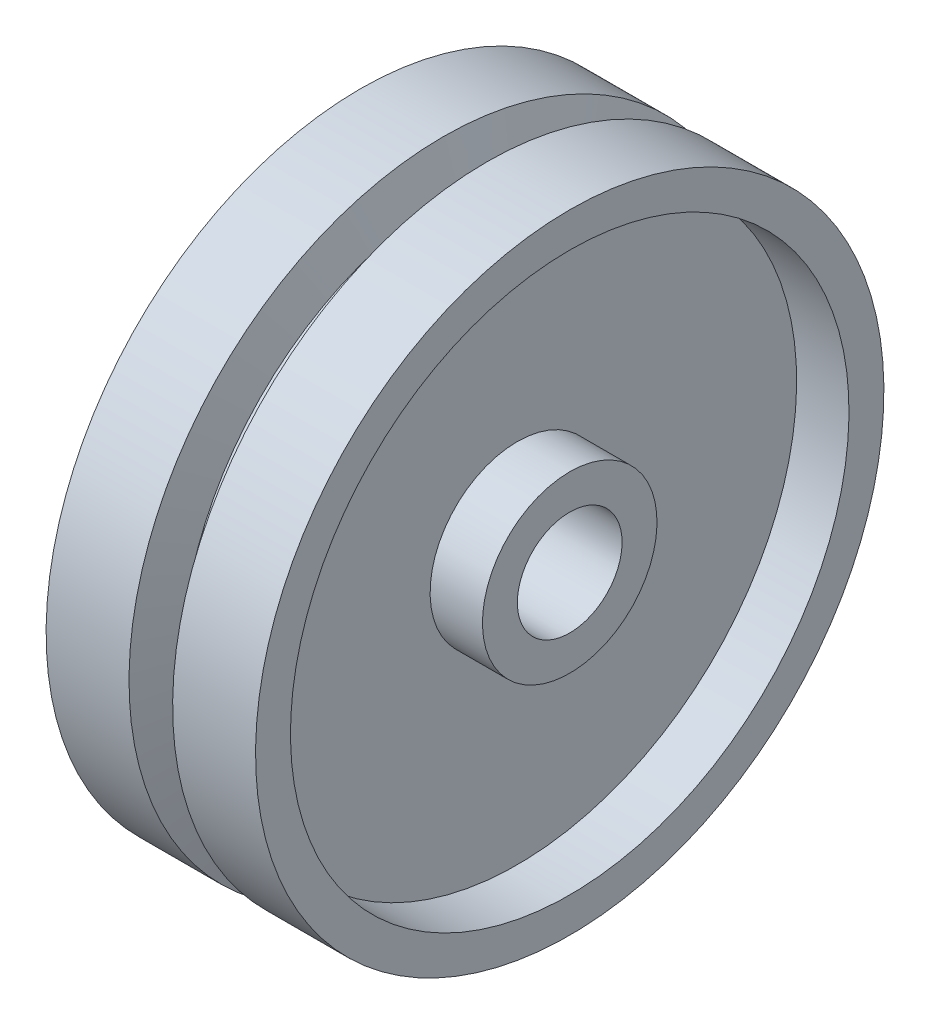
ISO-10303-21;
HEADER;
FILE_DESCRIPTION(('STEP AP214'),'2;1');
FILE_NAME('part.step','',(''),(''),'','','');
FILE_SCHEMA(('AUTOMOTIVE_DESIGN { 1 0 10303 214 1 1 1 1 }'));
ENDSEC;
DATA;
#1=APPLICATION_CONTEXT('core data for automotive mechanical design processes');
#2=APPLICATION_PROTOCOL_DEFINITION('international standard','automotive_design',2000,#1);
#3=PRODUCT_CONTEXT('',#1,'mechanical');
#4=PRODUCT('Part','Part','',(#3));
#5=PRODUCT_RELATED_PRODUCT_CATEGORY('part','',(#4));
#6=PRODUCT_DEFINITION_FORMATION('','',#4);
#7=PRODUCT_DEFINITION_CONTEXT('part definition',#1,'design');
#8=PRODUCT_DEFINITION('design','',#6,#7);
#9=PRODUCT_DEFINITION_SHAPE('','',#8);
#10=(LENGTH_UNIT() NAMED_UNIT(*) SI_UNIT(.MILLI.,.METRE.));
#11=(NAMED_UNIT(*) PLANE_ANGLE_UNIT() SI_UNIT($,.RADIAN.));
#12=(NAMED_UNIT(*) SI_UNIT($,.STERADIAN.) SOLID_ANGLE_UNIT());
#13=UNCERTAINTY_MEASURE_WITH_UNIT(LENGTH_MEASURE(1.E-05),#10,'distance_accuracy_value','');
#14=(GEOMETRIC_REPRESENTATION_CONTEXT(3) GLOBAL_UNCERTAINTY_ASSIGNED_CONTEXT((#13)) GLOBAL_UNIT_ASSIGNED_CONTEXT((#10,
#11,#12)) REPRESENTATION_CONTEXT('',''));
#15=CARTESIAN_POINT('',(0.,0.,0.));
#16=DIRECTION('',(0.,0.,1.));
#17=DIRECTION('',(1.,0.,0.));
#18=AXIS2_PLACEMENT_3D('',#15,#16,#17);
#19=CARTESIAN_POINT('',(0.,5.,0.));
#20=DIRECTION('',(1.,0.,0.));
#21=DIRECTION('',(0.,1.,0.));
#22=AXIS2_PLACEMENT_3D('',#19,#20,#21);
#23=PLANE('',#22);
#24=CARTESIAN_POINT('',(0.,0.,0.));
#25=DIRECTION('',(1.,0.,0.));
#26=DIRECTION('',(0.,1.,0.));
#27=AXIS2_PLACEMENT_3D('',#24,#25,#26);
#28=CIRCLE('',#27,5.);
#29=CARTESIAN_POINT('',(0.,5.,0.));
#30=VERTEX_POINT('',#29);
#31=EDGE_CURVE('E126',#30,#30,#28,.T.);
#32=ORIENTED_EDGE('',*,*,#31,.T.);
#33=EDGE_LOOP('',(#32));
#34=FACE_BOUND('',#33,.T.);
#35=CARTESIAN_POINT('',(0.,0.,0.));
#36=DIRECTION('',(1.,0.,0.));
#37=DIRECTION('',(0.,1.,0.));
#38=AXIS2_PLACEMENT_3D('',#35,#36,#37);
#39=CIRCLE('',#38,3.);
#40=CARTESIAN_POINT('',(0.,3.,0.));
#41=VERTEX_POINT('',#40);
#42=EDGE_CURVE('E10',#41,#41,#39,.T.);
#43=ORIENTED_EDGE('',*,*,#42,.F.);
#44=EDGE_LOOP('',(#43));
#45=FACE_BOUND('',#44,.T.);
#46=ADVANCED_FACE('F43',(#34,#45),#23,.T.);
#47=CARTESIAN_POINT('',(0.,0.,0.));
#48=DIRECTION('',(1.,0.,0.));
#49=DIRECTION('',(0.,1.,0.));
#50=AXIS2_PLACEMENT_3D('',#47,#48,#49);
#51=CYLINDRICAL_SURFACE('',#50,3.);
#52=ORIENTED_EDGE('',*,*,#42,.T.);
#53=EDGE_LOOP('',(#52));
#54=FACE_BOUND('',#53,.T.);
#55=CARTESIAN_POINT('',(-4.75,0.,0.));
#56=DIRECTION('',(1.,0.,0.));
#57=DIRECTION('',(0.,1.,0.));
#58=AXIS2_PLACEMENT_3D('',#55,#56,#57);
#59=CIRCLE('',#58,3.);
#60=CARTESIAN_POINT('',(-4.75,3.,0.));
#61=VERTEX_POINT('',#60);
#62=EDGE_CURVE('E50',#61,#61,#59,.T.);
#63=ORIENTED_EDGE('',*,*,#62,.F.);
#64=EDGE_LOOP('',(#63));
#65=FACE_BOUND('',#64,.T.);
#66=ADVANCED_FACE('F145',(#54,#65),#51,.F.);
#67=CARTESIAN_POINT('',(-5.5,0.,0.));
#68=DIRECTION('',(-1.,0.,0.));
#69=DIRECTION('',(0.,-1.,0.));
#70=AXIS2_PLACEMENT_3D('',#67,#68,#69);
#71=CONICAL_SURFACE('',#70,5.25,1.24904577239825);
#72=ORIENTED_EDGE('',*,*,#62,.T.);
#73=EDGE_LOOP('',(#72));
#74=FACE_BOUND('',#73,.T.);
#75=CARTESIAN_POINT('',(-5.5,0.,0.));
#76=DIRECTION('',(1.,0.,0.));
#77=DIRECTION('',(0.,1.,0.));
#78=AXIS2_PLACEMENT_3D('',#75,#76,#77);
#79=CIRCLE('',#78,5.25);
#80=CARTESIAN_POINT('',(-5.50000000000001,5.25,0.));
#81=VERTEX_POINT('',#80);
#82=EDGE_CURVE('E55',#81,#81,#79,.T.);
#83=ORIENTED_EDGE('',*,*,#82,.F.);
#84=EDGE_LOOP('',(#83));
#85=FACE_BOUND('',#84,.T.);
#86=ADVANCED_FACE('F149',(#74,#85),#71,.F.);
#87=CARTESIAN_POINT('',(0.,0.,0.));
#88=DIRECTION('',(1.,0.,0.));
#89=DIRECTION('',(0.,1.,0.));
#90=AXIS2_PLACEMENT_3D('',#87,#88,#89);
#91=CYLINDRICAL_SURFACE('',#90,5.25);
#92=ORIENTED_EDGE('',*,*,#82,.T.);
#93=EDGE_LOOP('',(#92));
#94=FACE_BOUND('',#93,.T.);
#95=CARTESIAN_POINT('',(-6.5,0.,0.));
#96=DIRECTION('',(1.,0.,0.));
#97=DIRECTION('',(0.,1.,0.));
#98=AXIS2_PLACEMENT_3D('',#95,#96,#97);
#99=CIRCLE('',#98,5.25);
#100=CARTESIAN_POINT('',(-6.5,5.25,0.));
#101=VERTEX_POINT('',#100);
#102=EDGE_CURVE('E60',#101,#101,#99,.T.);
#103=ORIENTED_EDGE('',*,*,#102,.F.);
#104=EDGE_LOOP('',(#103));
#105=FACE_BOUND('',#104,.T.);
#106=ADVANCED_FACE('F153',(#94,#105),#91,.F.);
#107=CARTESIAN_POINT('',(-7.25,0.,0.));
#108=DIRECTION('',(1.,0.,0.));
#109=DIRECTION('',(0.,1.,0.));
#110=AXIS2_PLACEMENT_3D('',#107,#108,#109);
#111=CONICAL_SURFACE('',#110,3.,1.24904577239826);
#112=ORIENTED_EDGE('',*,*,#102,.T.);
#113=EDGE_LOOP('',(#112));
#114=FACE_BOUND('',#113,.T.);
#115=CARTESIAN_POINT('',(-7.25,0.,0.));
#116=DIRECTION('',(1.,0.,0.));
#117=DIRECTION('',(0.,1.,0.));
#118=AXIS2_PLACEMENT_3D('',#115,#116,#117);
#119=CIRCLE('',#118,3.);
#120=CARTESIAN_POINT('',(-7.25,3.,0.));
#121=VERTEX_POINT('',#120);
#122=EDGE_CURVE('E66',#121,#121,#119,.T.);
#123=ORIENTED_EDGE('',*,*,#122,.F.);
#124=EDGE_LOOP('',(#123));
#125=FACE_BOUND('',#124,.T.);
#126=ADVANCED_FACE('F159',(#114,#125),#111,.F.);
#127=CARTESIAN_POINT('',(0.,0.,0.));
#128=DIRECTION('',(1.,0.,0.));
#129=DIRECTION('',(0.,1.,0.));
#130=AXIS2_PLACEMENT_3D('',#127,#128,#129);
#131=CYLINDRICAL_SURFACE('',#130,3.);
#132=ORIENTED_EDGE('',*,*,#122,.T.);
#133=EDGE_LOOP('',(#132));
#134=FACE_BOUND('',#133,.T.);
#135=CARTESIAN_POINT('',(-12.,0.,0.));
#136=DIRECTION('',(1.,0.,0.));
#137=DIRECTION('',(0.,1.,0.));
#138=AXIS2_PLACEMENT_3D('',#135,#136,#137);
#139=CIRCLE('',#138,3.);
#140=CARTESIAN_POINT('',(-12.,3.,0.));
#141=VERTEX_POINT('',#140);
#142=EDGE_CURVE('E70',#141,#141,#139,.T.);
#143=ORIENTED_EDGE('',*,*,#142,.F.);
#144=EDGE_LOOP('',(#143));
#145=FACE_BOUND('',#144,.T.);
#146=ADVANCED_FACE('F163',(#134,#145),#131,.F.);
#147=CARTESIAN_POINT('',(-12.,3.,0.));
#148=DIRECTION('',(-1.,0.,0.));
#149=DIRECTION('',(0.,-1.,0.));
#150=AXIS2_PLACEMENT_3D('',#147,#148,#149);
#151=PLANE('',#150);
#152=ORIENTED_EDGE('',*,*,#142,.T.);
#153=EDGE_LOOP('',(#152));
#154=FACE_BOUND('',#153,.T.);
#155=CARTESIAN_POINT('',(-12.,0.,0.));
#156=DIRECTION('',(1.,0.,0.));
#157=DIRECTION('',(0.,1.,0.));
#158=AXIS2_PLACEMENT_3D('',#155,#156,#157);
#159=CIRCLE('',#158,5.);
#160=CARTESIAN_POINT('',(-12.,5.,0.));
#161=VERTEX_POINT('',#160);
#162=EDGE_CURVE('E74',#161,#161,#159,.T.);
#163=ORIENTED_EDGE('',*,*,#162,.F.);
#164=EDGE_LOOP('',(#163));
#165=FACE_BOUND('',#164,.T.);
#166=ADVANCED_FACE('F167',(#154,#165),#151,.T.);
#167=CARTESIAN_POINT('',(0.,0.,0.));
#168=DIRECTION('',(1.,0.,0.));
#169=DIRECTION('',(0.,1.,0.));
#170=AXIS2_PLACEMENT_3D('',#167,#168,#169);
#171=CYLINDRICAL_SURFACE('',#170,5.);
#172=ORIENTED_EDGE('',*,*,#162,.T.);
#173=EDGE_LOOP('',(#172));
#174=FACE_BOUND('',#173,.T.);
#175=CARTESIAN_POINT('',(-9.,0.,0.));
#176=DIRECTION('',(1.,0.,0.));
#177=DIRECTION('',(0.,1.,0.));
#178=AXIS2_PLACEMENT_3D('',#175,#176,#177);
#179=CIRCLE('',#178,5.);
#180=CARTESIAN_POINT('',(-9.,5.,0.));
#181=VERTEX_POINT('',#180);
#182=EDGE_CURVE('E78',#181,#181,#179,.T.);
#183=ORIENTED_EDGE('',*,*,#182,.F.);
#184=EDGE_LOOP('',(#183));
#185=FACE_BOUND('',#184,.T.);
#186=ADVANCED_FACE('F171',(#174,#185),#171,.T.);
#187=CARTESIAN_POINT('',(-9.,5.,0.));
#188=DIRECTION('',(-1.,0.,0.));
#189=DIRECTION('',(0.,-1.,0.));
#190=AXIS2_PLACEMENT_3D('',#187,#188,#189);
#191=PLANE('',#190);
#192=ORIENTED_EDGE('',*,*,#182,.T.);
#193=EDGE_LOOP('',(#192));
#194=FACE_BOUND('',#193,.T.);
#195=CARTESIAN_POINT('',(-9.,0.,0.));
#196=DIRECTION('',(1.,0.,0.));
#197=DIRECTION('',(0.,1.,0.));
#198=AXIS2_PLACEMENT_3D('',#195,#196,#197);
#199=CIRCLE('',#198,16.);
#200=CARTESIAN_POINT('',(-9.,16.,0.));
#201=VERTEX_POINT('',#200);
#202=EDGE_CURVE('E82',#201,#201,#199,.T.);
#203=ORIENTED_EDGE('',*,*,#202,.F.);
#204=EDGE_LOOP('',(#203));
#205=FACE_BOUND('',#204,.T.);
#206=ADVANCED_FACE('F175',(#194,#205),#191,.T.);
#207=CARTESIAN_POINT('',(0.,0.,0.));
#208=DIRECTION('',(1.,0.,0.));
#209=DIRECTION('',(0.,1.,0.));
#210=AXIS2_PLACEMENT_3D('',#207,#208,#209);
#211=CYLINDRICAL_SURFACE('',#210,16.);
#212=ORIENTED_EDGE('',*,*,#202,.T.);
#213=EDGE_LOOP('',(#212));
#214=FACE_BOUND('',#213,.T.);
#215=CARTESIAN_POINT('',(-12.,0.,0.));
#216=DIRECTION('',(1.,0.,0.));
#217=DIRECTION('',(0.,1.,0.));
#218=AXIS2_PLACEMENT_3D('',#215,#216,#217);
#219=CIRCLE('',#218,16.);
#220=CARTESIAN_POINT('',(-12.,16.,0.));
#221=VERTEX_POINT('',#220);
#222=EDGE_CURVE('E86',#221,#221,#219,.T.);
#223=ORIENTED_EDGE('',*,*,#222,.F.);
#224=EDGE_LOOP('',(#223));
#225=FACE_BOUND('',#224,.T.);
#226=ADVANCED_FACE('F179',(#214,#225),#211,.F.);
#227=CARTESIAN_POINT('',(-12.,16.,0.));
#228=DIRECTION('',(-1.,0.,0.));
#229=DIRECTION('',(0.,-1.,0.));
#230=AXIS2_PLACEMENT_3D('',#227,#228,#229);
#231=PLANE('',#230);
#232=ORIENTED_EDGE('',*,*,#222,.T.);
#233=EDGE_LOOP('',(#232));
#234=FACE_BOUND('',#233,.T.);
#235=CARTESIAN_POINT('',(-12.,0.,0.));
#236=DIRECTION('',(1.,0.,0.));
#237=DIRECTION('',(0.,1.,0.));
#238=AXIS2_PLACEMENT_3D('',#235,#236,#237);
#239=CIRCLE('',#238,18.);
#240=CARTESIAN_POINT('',(-12.,18.,0.));
#241=VERTEX_POINT('',#240);
#242=EDGE_CURVE('E90',#241,#241,#239,.T.);
#243=ORIENTED_EDGE('',*,*,#242,.F.);
#244=EDGE_LOOP('',(#243));
#245=FACE_BOUND('',#244,.T.);
#246=ADVANCED_FACE('F183',(#234,#245),#231,.T.);
#247=CARTESIAN_POINT('',(0.,0.,0.));
#248=DIRECTION('',(1.,0.,0.));
#249=DIRECTION('',(0.,1.,0.));
#250=AXIS2_PLACEMENT_3D('',#247,#248,#249);
#251=CYLINDRICAL_SURFACE('',#250,18.);
#252=ORIENTED_EDGE('',*,*,#242,.T.);
#253=EDGE_LOOP('',(#252));
#254=FACE_BOUND('',#253,.T.);
#255=CARTESIAN_POINT('',(-7.25,0.,0.));
#256=DIRECTION('',(1.,0.,0.));
#257=DIRECTION('',(0.,1.,0.));
#258=AXIS2_PLACEMENT_3D('',#255,#256,#257);
#259=CIRCLE('',#258,18.);
#260=CARTESIAN_POINT('',(-7.25000000000001,18.,0.));
#261=VERTEX_POINT('',#260);
#262=EDGE_CURVE('E94',#261,#261,#259,.T.);
#263=ORIENTED_EDGE('',*,*,#262,.F.);
#264=EDGE_LOOP('',(#263));
#265=FACE_BOUND('',#264,.T.);
#266=ADVANCED_FACE('F187',(#254,#265),#251,.T.);
#267=CARTESIAN_POINT('',(-6.5,0.,0.));
#268=DIRECTION('',(-1.,0.,0.));
#269=DIRECTION('',(0.,-1.,0.));
#270=AXIS2_PLACEMENT_3D('',#267,#268,#269);
#271=CONICAL_SURFACE('',#270,15.75,1.24904577239825);
#272=ORIENTED_EDGE('',*,*,#262,.T.);
#273=EDGE_LOOP('',(#272));
#274=FACE_BOUND('',#273,.T.);
#275=CARTESIAN_POINT('',(-6.5,0.,0.));
#276=DIRECTION('',(1.,0.,0.));
#277=DIRECTION('',(0.,1.,0.));
#278=AXIS2_PLACEMENT_3D('',#275,#276,#277);
#279=CIRCLE('',#278,15.75);
#280=CARTESIAN_POINT('',(-6.5,15.75,0.));
#281=VERTEX_POINT('',#280);
#282=EDGE_CURVE('E98',#281,#281,#279,.T.);
#283=ORIENTED_EDGE('',*,*,#282,.F.);
#284=EDGE_LOOP('',(#283));
#285=FACE_BOUND('',#284,.T.);
#286=ADVANCED_FACE('F191',(#274,#285),#271,.T.);
#287=CARTESIAN_POINT('',(0.,0.,0.));
#288=DIRECTION('',(1.,0.,0.));
#289=DIRECTION('',(0.,1.,0.));
#290=AXIS2_PLACEMENT_3D('',#287,#288,#289);
#291=CYLINDRICAL_SURFACE('',#290,15.75);
#292=ORIENTED_EDGE('',*,*,#282,.T.);
#293=EDGE_LOOP('',(#292));
#294=FACE_BOUND('',#293,.T.);
#295=CARTESIAN_POINT('',(-5.5,0.,0.));
#296=DIRECTION('',(1.,0.,0.));
#297=DIRECTION('',(0.,1.,0.));
#298=AXIS2_PLACEMENT_3D('',#295,#296,#297);
#299=CIRCLE('',#298,15.75);
#300=CARTESIAN_POINT('',(-5.50000000000001,15.75,0.));
#301=VERTEX_POINT('',#300);
#302=EDGE_CURVE('E102',#301,#301,#299,.T.);
#303=ORIENTED_EDGE('',*,*,#302,.F.);
#304=EDGE_LOOP('',(#303));
#305=FACE_BOUND('',#304,.T.);
#306=ADVANCED_FACE('F195',(#294,#305),#291,.T.);
#307=CARTESIAN_POINT('',(-4.75,0.,0.));
#308=DIRECTION('',(1.,0.,0.));
#309=DIRECTION('',(0.,1.,0.));
#310=AXIS2_PLACEMENT_3D('',#307,#308,#309);
#311=CONICAL_SURFACE('',#310,18.,1.24904577239825);
#312=ORIENTED_EDGE('',*,*,#302,.T.);
#313=EDGE_LOOP('',(#312));
#314=FACE_BOUND('',#313,.T.);
#315=CARTESIAN_POINT('',(-4.75,0.,0.));
#316=DIRECTION('',(1.,0.,0.));
#317=DIRECTION('',(0.,1.,0.));
#318=AXIS2_PLACEMENT_3D('',#315,#316,#317);
#319=CIRCLE('',#318,18.);
#320=CARTESIAN_POINT('',(-4.75000000000001,18.,0.));
#321=VERTEX_POINT('',#320);
#322=EDGE_CURVE('E106',#321,#321,#319,.T.);
#323=ORIENTED_EDGE('',*,*,#322,.F.);
#324=EDGE_LOOP('',(#323));
#325=FACE_BOUND('',#324,.T.);
#326=ADVANCED_FACE('F199',(#314,#325),#311,.T.);
#327=CARTESIAN_POINT('',(0.,0.,0.));
#328=DIRECTION('',(1.,0.,0.));
#329=DIRECTION('',(0.,1.,0.));
#330=AXIS2_PLACEMENT_3D('',#327,#328,#329);
#331=CYLINDRICAL_SURFACE('',#330,18.);
#332=ORIENTED_EDGE('',*,*,#322,.T.);
#333=EDGE_LOOP('',(#332));
#334=FACE_BOUND('',#333,.T.);
#335=CARTESIAN_POINT('',(0.,0.,0.));
#336=DIRECTION('',(1.,0.,0.));
#337=DIRECTION('',(0.,1.,0.));
#338=AXIS2_PLACEMENT_3D('',#335,#336,#337);
#339=CIRCLE('',#338,18.);
#340=CARTESIAN_POINT('',(0.,18.,0.));
#341=VERTEX_POINT('',#340);
#342=EDGE_CURVE('E110',#341,#341,#339,.T.);
#343=ORIENTED_EDGE('',*,*,#342,.F.);
#344=EDGE_LOOP('',(#343));
#345=FACE_BOUND('',#344,.T.);
#346=ADVANCED_FACE('F203',(#334,#345),#331,.T.);
#347=CARTESIAN_POINT('',(0.,18.,0.));
#348=DIRECTION('',(1.,0.,0.));
#349=DIRECTION('',(0.,1.,0.));
#350=AXIS2_PLACEMENT_3D('',#347,#348,#349);
#351=PLANE('',#350);
#352=ORIENTED_EDGE('',*,*,#342,.T.);
#353=EDGE_LOOP('',(#352));
#354=FACE_BOUND('',#353,.T.);
#355=CARTESIAN_POINT('',(0.,0.,0.));
#356=DIRECTION('',(1.,0.,0.));
#357=DIRECTION('',(0.,1.,0.));
#358=AXIS2_PLACEMENT_3D('',#355,#356,#357);
#359=CIRCLE('',#358,16.);
#360=CARTESIAN_POINT('',(0.,16.,0.));
#361=VERTEX_POINT('',#360);
#362=EDGE_CURVE('E114',#361,#361,#359,.T.);
#363=ORIENTED_EDGE('',*,*,#362,.F.);
#364=EDGE_LOOP('',(#363));
#365=FACE_BOUND('',#364,.T.);
#366=ADVANCED_FACE('F207',(#354,#365),#351,.T.);
#367=CARTESIAN_POINT('',(0.,0.,0.));
#368=DIRECTION('',(1.,0.,0.));
#369=DIRECTION('',(0.,1.,0.));
#370=AXIS2_PLACEMENT_3D('',#367,#368,#369);
#371=CYLINDRICAL_SURFACE('',#370,16.);
#372=ORIENTED_EDGE('',*,*,#362,.T.);
#373=EDGE_LOOP('',(#372));
#374=FACE_BOUND('',#373,.T.);
#375=CARTESIAN_POINT('',(-3.,0.,0.));
#376=DIRECTION('',(1.,0.,0.));
#377=DIRECTION('',(0.,1.,0.));
#378=AXIS2_PLACEMENT_3D('',#375,#376,#377);
#379=CIRCLE('',#378,16.);
#380=CARTESIAN_POINT('',(-3.,16.,0.));
#381=VERTEX_POINT('',#380);
#382=EDGE_CURVE('E118',#381,#381,#379,.T.);
#383=ORIENTED_EDGE('',*,*,#382,.F.);
#384=EDGE_LOOP('',(#383));
#385=FACE_BOUND('',#384,.T.);
#386=ADVANCED_FACE('F141',(#374,#385),#371,.F.);
#387=CARTESIAN_POINT('',(-3.,16.,0.));
#388=DIRECTION('',(1.,0.,0.));
#389=DIRECTION('',(0.,1.,0.));
#390=AXIS2_PLACEMENT_3D('',#387,#388,#389);
#391=PLANE('',#390);
#392=ORIENTED_EDGE('',*,*,#382,.T.);
#393=EDGE_LOOP('',(#392));
#394=FACE_BOUND('',#393,.T.);
#395=CARTESIAN_POINT('',(-3.,0.,0.));
#396=DIRECTION('',(1.,0.,0.));
#397=DIRECTION('',(0.,1.,0.));
#398=AXIS2_PLACEMENT_3D('',#395,#396,#397);
#399=CIRCLE('',#398,5.);
#400=CARTESIAN_POINT('',(-3.,5.,0.));
#401=VERTEX_POINT('',#400);
#402=EDGE_CURVE('E122',#401,#401,#399,.T.);
#403=ORIENTED_EDGE('',*,*,#402,.F.);
#404=EDGE_LOOP('',(#403));
#405=FACE_BOUND('',#404,.T.);
#406=ADVANCED_FACE('F135',(#394,#405),#391,.T.);
#407=CARTESIAN_POINT('',(0.,0.,0.));
#408=DIRECTION('',(1.,0.,0.));
#409=DIRECTION('',(0.,1.,0.));
#410=AXIS2_PLACEMENT_3D('',#407,#408,#409);
#411=CYLINDRICAL_SURFACE('',#410,5.);
#412=ORIENTED_EDGE('',*,*,#402,.T.);
#413=EDGE_LOOP('',(#412));
#414=FACE_BOUND('',#413,.T.);
#415=ORIENTED_EDGE('',*,*,#31,.F.);
#416=EDGE_LOOP('',(#415));
#417=FACE_BOUND('',#416,.T.);
#418=ADVANCED_FACE('F133',(#414,#417),#411,.T.);
#419=CLOSED_SHELL('',(#46,#66,#86,#106,#126,#146,#166,#186,#206,#226,#246,#266,#286,#306,#326,
#346,#366,#386,#406,#418));
#420=MANIFOLD_SOLID_BREP('B2',#419);
#421=ADVANCED_BREP_SHAPE_REPRESENTATION('',(#18,#420),#14);
#422=SHAPE_DEFINITION_REPRESENTATION(#9,#421);
ENDSEC;
END-ISO-10303-21;
